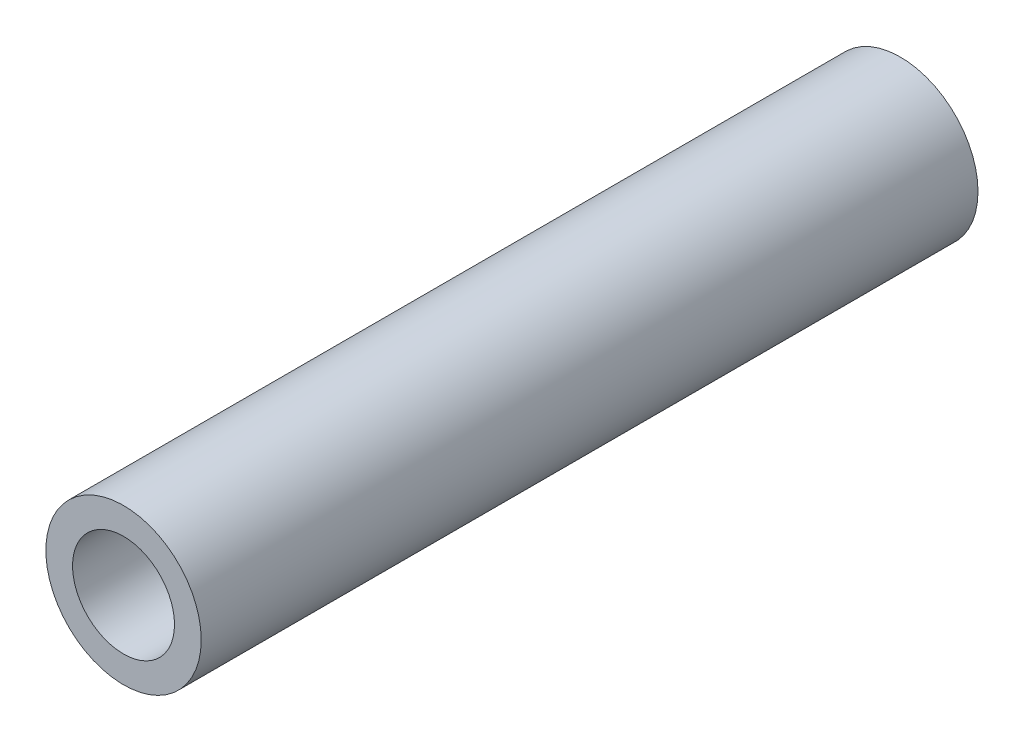
ISO-10303-21;
HEADER;
FILE_DESCRIPTION(('STEP AP214'),'2;1');
FILE_NAME('part.step','',(''),(''),'','','');
FILE_SCHEMA(('AUTOMOTIVE_DESIGN { 1 0 10303 214 1 1 1 1 }'));
ENDSEC;
DATA;
#1=APPLICATION_CONTEXT('core data for automotive mechanical design processes');
#2=APPLICATION_PROTOCOL_DEFINITION('international standard','automotive_design',2000,#1);
#3=PRODUCT_CONTEXT('',#1,'mechanical');
#4=PRODUCT('Part','Part','',(#3));
#5=PRODUCT_RELATED_PRODUCT_CATEGORY('part','',(#4));
#6=PRODUCT_DEFINITION_FORMATION('','',#4);
#7=PRODUCT_DEFINITION_CONTEXT('part definition',#1,'design');
#8=PRODUCT_DEFINITION('design','',#6,#7);
#9=PRODUCT_DEFINITION_SHAPE('','',#8);
#10=(LENGTH_UNIT() NAMED_UNIT(*) SI_UNIT(.MILLI.,.METRE.));
#11=(NAMED_UNIT(*) PLANE_ANGLE_UNIT() SI_UNIT($,.RADIAN.));
#12=(NAMED_UNIT(*) SI_UNIT($,.STERADIAN.) SOLID_ANGLE_UNIT());
#13=UNCERTAINTY_MEASURE_WITH_UNIT(LENGTH_MEASURE(1.E-05),#10,'distance_accuracy_value','');
#14=(GEOMETRIC_REPRESENTATION_CONTEXT(3) GLOBAL_UNCERTAINTY_ASSIGNED_CONTEXT((#13)) GLOBAL_UNIT_ASSIGNED_CONTEXT((#10,
#11,#12)) REPRESENTATION_CONTEXT('',''));
#15=CARTESIAN_POINT('',(0.,0.,0.));
#16=DIRECTION('',(0.,0.,1.));
#17=DIRECTION('',(1.,0.,0.));
#18=AXIS2_PLACEMENT_3D('',#15,#16,#17);
#19=CARTESIAN_POINT('',(0.,0.,127.));
#20=DIRECTION('',(0.,0.,1.));
#21=DIRECTION('',(1.,0.,0.));
#22=AXIS2_PLACEMENT_3D('',#19,#20,#21);
#23=PLANE('',#22);
#24=CARTESIAN_POINT('',(0.,0.,127.));
#25=DIRECTION('',(0.,0.,1.));
#26=DIRECTION('',(1.,0.,0.));
#27=AXIS2_PLACEMENT_3D('',#24,#25,#26);
#28=CIRCLE('',#27,12.7);
#29=CARTESIAN_POINT('',(12.7,0.,127.));
#30=VERTEX_POINT('',#29);
#31=EDGE_CURVE('E10',#30,#30,#28,.T.);
#32=ORIENTED_EDGE('',*,*,#31,.T.);
#33=EDGE_LOOP('',(#32));
#34=FACE_BOUND('',#33,.T.);
#35=CARTESIAN_POINT('',(0.,0.,127.));
#36=DIRECTION('',(0.,0.,1.));
#37=DIRECTION('',(1.,0.,0.));
#38=AXIS2_PLACEMENT_3D('',#35,#36,#37);
#39=CIRCLE('',#38,8.33374);
#40=CARTESIAN_POINT('',(8.33374,0.,127.));
#41=VERTEX_POINT('',#40);
#42=EDGE_CURVE('E46',#41,#41,#39,.T.);
#43=ORIENTED_EDGE('',*,*,#42,.F.);
#44=EDGE_LOOP('',(#43));
#45=FACE_BOUND('',#44,.T.);
#46=ADVANCED_FACE('F35',(#34,#45),#23,.T.);
#47=CARTESIAN_POINT('',(0.,0.,0.));
#48=DIRECTION('',(0.,0.,1.));
#49=DIRECTION('',(1.,0.,0.));
#50=AXIS2_PLACEMENT_3D('',#47,#48,#49);
#51=PLANE('',#50);
#52=CARTESIAN_POINT('',(0.,0.,0.));
#53=DIRECTION('',(0.,0.,1.));
#54=DIRECTION('',(1.,0.,0.));
#55=AXIS2_PLACEMENT_3D('',#52,#53,#54);
#56=CIRCLE('',#55,12.7);
#57=CARTESIAN_POINT('',(12.7,0.,0.));
#58=VERTEX_POINT('',#57);
#59=EDGE_CURVE('E39',#58,#58,#56,.T.);
#60=ORIENTED_EDGE('',*,*,#59,.F.);
#61=EDGE_LOOP('',(#60));
#62=FACE_BOUND('',#61,.T.);
#63=CARTESIAN_POINT('',(0.,0.,0.));
#64=DIRECTION('',(0.,0.,1.));
#65=DIRECTION('',(1.,0.,0.));
#66=AXIS2_PLACEMENT_3D('',#63,#64,#65);
#67=CIRCLE('',#66,8.33374);
#68=CARTESIAN_POINT('',(8.33374,0.,0.));
#69=VERTEX_POINT('',#68);
#70=EDGE_CURVE('E48',#69,#69,#67,.T.);
#71=ORIENTED_EDGE('',*,*,#70,.T.);
#72=EDGE_LOOP('',(#71));
#73=FACE_BOUND('',#72,.T.);
#74=ADVANCED_FACE('F58',(#62,#73),#51,.F.);
#75=CARTESIAN_POINT('',(0.,0.,127.));
#76=DIRECTION('',(0.,0.,-1.));
#77=DIRECTION('',(-1.,0.,0.));
#78=AXIS2_PLACEMENT_3D('',#75,#76,#77);
#79=CYLINDRICAL_SURFACE('',#78,12.7);
#80=ORIENTED_EDGE('',*,*,#31,.F.);
#81=EDGE_LOOP('',(#80));
#82=FACE_BOUND('',#81,.T.);
#83=ORIENTED_EDGE('',*,*,#59,.T.);
#84=EDGE_LOOP('',(#83));
#85=FACE_BOUND('',#84,.T.);
#86=ADVANCED_FACE('F37',(#82,#85),#79,.T.);
#87=CARTESIAN_POINT('',(0.,0.,127.));
#88=DIRECTION('',(0.,0.,-1.));
#89=DIRECTION('',(-1.,0.,0.));
#90=AXIS2_PLACEMENT_3D('',#87,#88,#89);
#91=CYLINDRICAL_SURFACE('',#90,8.33374);
#92=ORIENTED_EDGE('',*,*,#42,.T.);
#93=EDGE_LOOP('',(#92));
#94=FACE_BOUND('',#93,.T.);
#95=ORIENTED_EDGE('',*,*,#70,.F.);
#96=EDGE_LOOP('',(#95));
#97=FACE_BOUND('',#96,.T.);
#98=ADVANCED_FACE('F54',(#94,#97),#91,.F.);
#99=CLOSED_SHELL('',(#46,#74,#86,#98));
#100=MANIFOLD_SOLID_BREP('B2',#99);
#101=ADVANCED_BREP_SHAPE_REPRESENTATION('',(#18,#100),#14);
#102=SHAPE_DEFINITION_REPRESENTATION(#9,#101);
ENDSEC;
END-ISO-10303-21;
